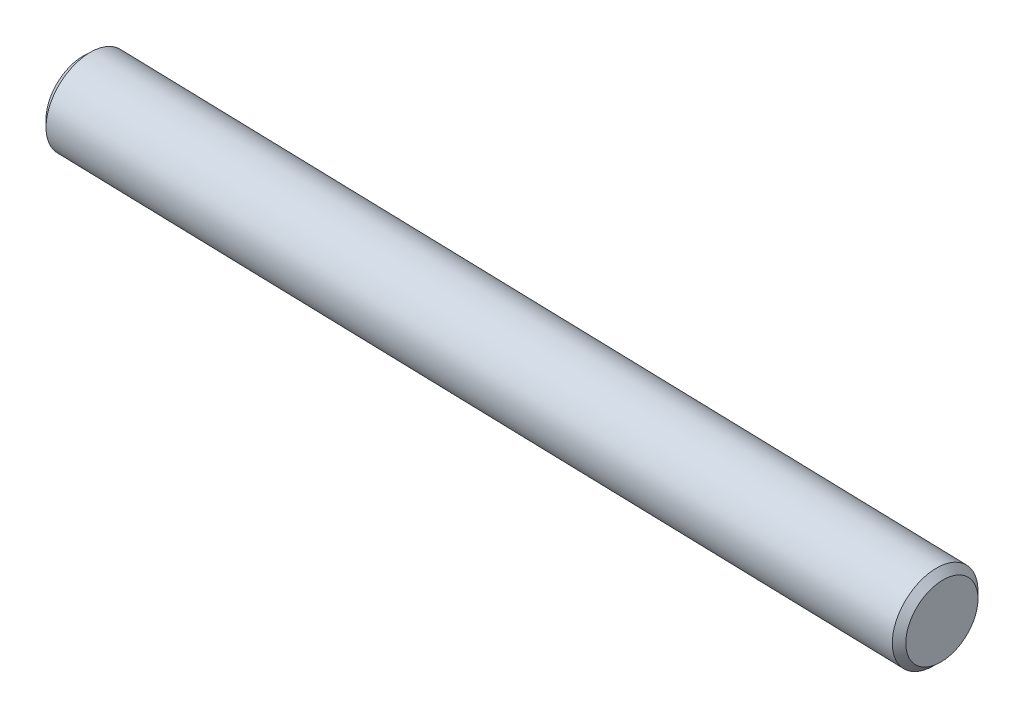
ISO-10303-21;
HEADER;
FILE_DESCRIPTION(('STEP AP214'),'2;1');
FILE_NAME('part.step','',(''),(''),'','','');
FILE_SCHEMA(('AUTOMOTIVE_DESIGN { 1 0 10303 214 1 1 1 1 }'));
ENDSEC;
DATA;
#1=APPLICATION_CONTEXT('core data for automotive mechanical design processes');
#2=APPLICATION_PROTOCOL_DEFINITION('international standard','automotive_design',2000,#1);
#3=PRODUCT_CONTEXT('',#1,'mechanical');
#4=PRODUCT('Part','Part','',(#3));
#5=PRODUCT_RELATED_PRODUCT_CATEGORY('part','',(#4));
#6=PRODUCT_DEFINITION_FORMATION('','',#4);
#7=PRODUCT_DEFINITION_CONTEXT('part definition',#1,'design');
#8=PRODUCT_DEFINITION('design','',#6,#7);
#9=PRODUCT_DEFINITION_SHAPE('','',#8);
#10=(LENGTH_UNIT() NAMED_UNIT(*) SI_UNIT(.MILLI.,.METRE.));
#11=(NAMED_UNIT(*) PLANE_ANGLE_UNIT() SI_UNIT($,.RADIAN.));
#12=(NAMED_UNIT(*) SI_UNIT($,.STERADIAN.) SOLID_ANGLE_UNIT());
#13=UNCERTAINTY_MEASURE_WITH_UNIT(LENGTH_MEASURE(1.E-05),#10,'distance_accuracy_value','');
#14=(GEOMETRIC_REPRESENTATION_CONTEXT(3) GLOBAL_UNCERTAINTY_ASSIGNED_CONTEXT((#13)) GLOBAL_UNIT_ASSIGNED_CONTEXT((#10,
#11,#12)) REPRESENTATION_CONTEXT('',''));
#15=CARTESIAN_POINT('',(0.,0.,0.));
#16=DIRECTION('',(0.,0.,1.));
#17=DIRECTION('',(1.,0.,0.));
#18=AXIS2_PLACEMENT_3D('',#15,#16,#17);
#19=CARTESIAN_POINT('',(384.266488658689,6181.0424055754,3272.22022114494));
#20=DIRECTION('',(-0.999551190889575,0.0298893502299077,0.00201085406403378));
#21=DIRECTION('',(-0.0298894106593939,-0.999553211755349,0.));
#22=AXIS2_PLACEMENT_3D('',#19,#20,#21);
#23=PLANE('',#22);
#24=CARTESIAN_POINT('',(384.281902460515,6181.90435191757,3267.07010491465));
#25=DIRECTION('',(-0.99955119088956,0.0298893502304004,0.00201085406388751));
#26=DIRECTION('',(-0.0298894106598866,-0.999553211755335,0.));
#27=AXIS2_PLACEMENT_3D('',#24,#25,#26);
#28=CIRCLE('',#27,2.67500000003119);
#29=CARTESIAN_POINT('',(384.201948286999,6179.23054707609,3267.07010491465));
#30=VERTEX_POINT('',#29);
#31=EDGE_CURVE('E17',#30,#30,#28,.T.);
#32=ORIENTED_EDGE('',*,*,#31,.F.);
#33=EDGE_LOOP('',(#32));
#34=FACE_BOUND('',#33,.T.);
#35=ADVANCED_FACE('F14',(#34),#23,.F.);
#36=CARTESIAN_POINT('',(320.794988037201,6182.94037931501,3272.34791037803));
#37=DIRECTION('',(-0.999551190889575,0.0298893502299077,0.00201085406403378));
#38=DIRECTION('',(-0.0298894106593939,-0.999553211755349,0.));
#39=AXIS2_PLACEMENT_3D('',#36,#37,#38);
#40=PLANE('',#39);
#41=CARTESIAN_POINT('',(320.810401839054,6183.80232565715,3267.1977941477));
#42=DIRECTION('',(0.99955119088956,-0.029889350230425,-0.00201085406388704));
#43=DIRECTION('',(0.0298894106599112,0.999553211755334,0.));
#44=AXIS2_PLACEMENT_3D('',#41,#42,#43);
#45=CIRCLE('',#44,2.67499999998919);
#46=CARTESIAN_POINT('',(320.890356012569,6186.47613049859,3267.1977941477));
#47=VERTEX_POINT('',#46);
#48=EDGE_CURVE('E29',#47,#47,#45,.T.);
#49=ORIENTED_EDGE('',*,*,#48,.F.);
#50=EDGE_LOOP('',(#49));
#51=FACE_BOUND('',#50,.T.);
#52=ADVANCED_FACE('F45',(#51),#40,.T.);
#53=CARTESIAN_POINT('',(383.78212686524,6181.91929659268,3267.07111034168));
#54=DIRECTION('',(-0.99955119088956,0.0298893502304004,0.00201085406388751));
#55=DIRECTION('',(-0.0298894106598866,-0.999553211755335,0.));
#56=AXIS2_PLACEMENT_3D('',#53,#54,#55);
#57=CONICAL_SURFACE('',#56,3.17499999984658,0.785398163383249);
#58=ORIENTED_EDGE('',*,*,#31,.T.);
#59=EDGE_LOOP('',(#58));
#60=FACE_BOUND('',#59,.T.);
#61=CARTESIAN_POINT('',(383.782126865047,6181.91929659269,3267.07111034168));
#62=DIRECTION('',(-0.999551190889575,0.0298893502299018,0.00201085406403407));
#63=DIRECTION('',(-0.029889410659388,-0.99955321175535,0.));
#64=AXIS2_PLACEMENT_3D('',#61,#62,#63);
#65=CIRCLE('',#64,3.17499999999995);
#66=CARTESIAN_POINT('',(383.687227986203,6178.74571514537,3267.07111034168));
#67=VERTEX_POINT('',#66);
#68=EDGE_CURVE('E22',#67,#67,#65,.T.);
#69=ORIENTED_EDGE('',*,*,#68,.F.);
#70=EDGE_LOOP('',(#69));
#71=FACE_BOUND('',#70,.T.);
#72=ADVANCED_FACE('F41',(#60,#71),#57,.T.);
#73=CARTESIAN_POINT('',(321.310177434441,6183.78738098204,3267.19678872067));
#74=DIRECTION('',(0.99955119088956,-0.029889350230425,-0.00201085406388704));
#75=DIRECTION('',(0.0298894106599112,0.999553211755334,0.));
#76=AXIS2_PLACEMENT_3D('',#73,#74,#75);
#77=CONICAL_SURFACE('',#76,3.17499999991678,0.785398163382693);
#78=ORIENTED_EDGE('',*,*,#48,.T.);
#79=EDGE_LOOP('',(#78));
#80=FACE_BOUND('',#79,.T.);
#81=CARTESIAN_POINT('',(321.310177434448,6183.78738098206,3267.19678872068));
#82=DIRECTION('',(-0.999551190889575,0.0298893502299018,0.00201085406403407));
#83=DIRECTION('',(-0.029889410659388,-0.99955321175535,0.));
#84=AXIS2_PLACEMENT_3D('',#81,#82,#83);
#85=CIRCLE('',#84,3.17499999999995);
#86=CARTESIAN_POINT('',(321.215278555604,6180.61379953474,3267.19678872068));
#87=VERTEX_POINT('',#86);
#88=EDGE_CURVE('E10',#87,#87,#85,.F.);
#89=ORIENTED_EDGE('',*,*,#88,.F.);
#90=EDGE_LOOP('',(#89));
#91=FACE_BOUND('',#90,.T.);
#92=ADVANCED_FACE('F53',(#80,#91),#77,.T.);
#93=CARTESIAN_POINT('',(341.12128203788,6183.1949740605,3267.15693359313));
#94=DIRECTION('',(-0.999551190889575,0.0298893502299018,0.00201085406403407));
#95=DIRECTION('',(-0.029889410659388,-0.99955321175535,0.));
#96=AXIS2_PLACEMENT_3D('',#93,#94,#95);
#97=CYLINDRICAL_SURFACE('',#96,3.17499999999995);
#98=ORIENTED_EDGE('',*,*,#88,.T.);
#99=EDGE_LOOP('',(#98));
#100=FACE_BOUND('',#99,.T.);
#101=ORIENTED_EDGE('',*,*,#68,.T.);
#102=EDGE_LOOP('',(#101));
#103=FACE_BOUND('',#102,.T.);
#104=ADVANCED_FACE('F51',(#100,#103),#97,.T.);
#105=CLOSED_SHELL('',(#35,#52,#72,#92,#104));
#106=MANIFOLD_SOLID_BREP('B1',#105);
#107=ADVANCED_BREP_SHAPE_REPRESENTATION('',(#18,#106),#14);
#108=SHAPE_DEFINITION_REPRESENTATION(#9,#107);
ENDSEC;
END-ISO-10303-21;
